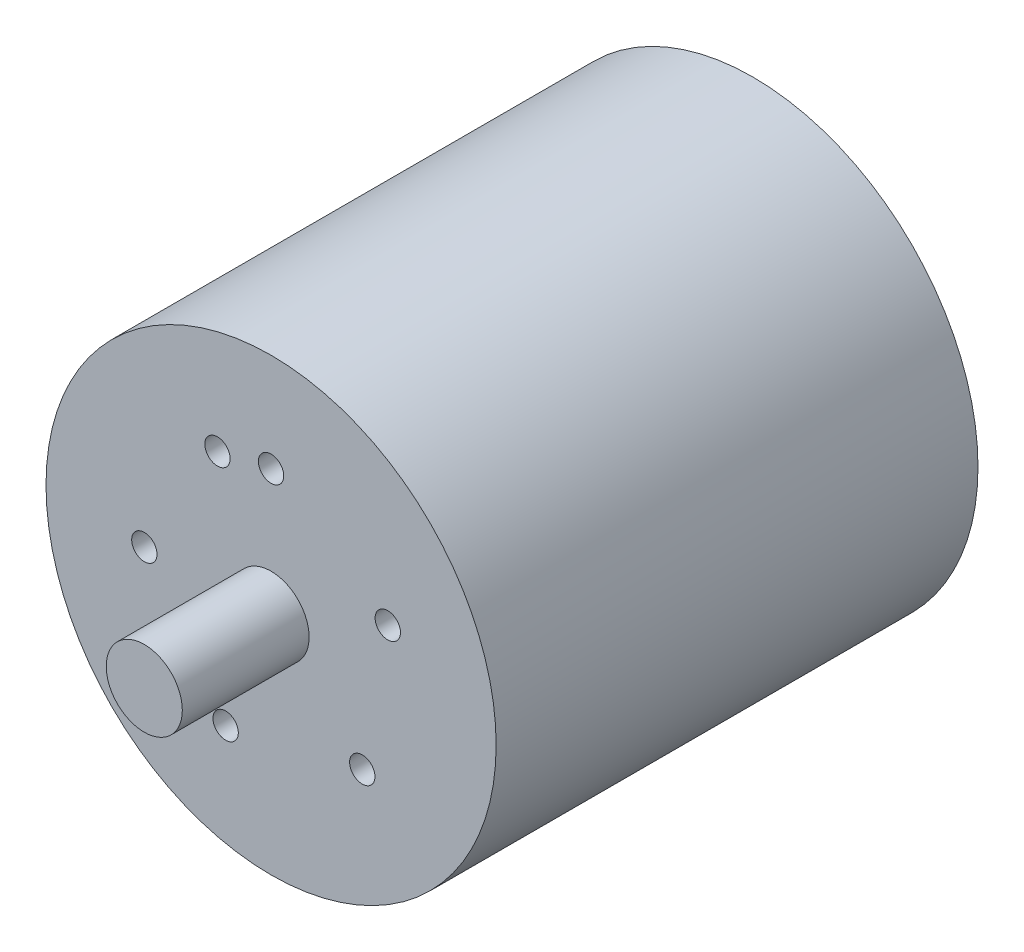
ISO-10303-21;
HEADER;
FILE_DESCRIPTION(('STEP AP214'),'2;1');
FILE_NAME('part.step','',(''),(''),'','','');
FILE_SCHEMA(('AUTOMOTIVE_DESIGN { 1 0 10303 214 1 1 1 1 }'));
ENDSEC;
DATA;
#1=APPLICATION_CONTEXT('core data for automotive mechanical design processes');
#2=APPLICATION_PROTOCOL_DEFINITION('international standard','automotive_design',2000,#1);
#3=PRODUCT_CONTEXT('',#1,'mechanical');
#4=PRODUCT('Part','Part','',(#3));
#5=PRODUCT_RELATED_PRODUCT_CATEGORY('part','',(#4));
#6=PRODUCT_DEFINITION_FORMATION('','',#4);
#7=PRODUCT_DEFINITION_CONTEXT('part definition',#1,'design');
#8=PRODUCT_DEFINITION('design','',#6,#7);
#9=PRODUCT_DEFINITION_SHAPE('','',#8);
#10=(LENGTH_UNIT() NAMED_UNIT(*) SI_UNIT(.MILLI.,.METRE.));
#11=(NAMED_UNIT(*) PLANE_ANGLE_UNIT() SI_UNIT($,.RADIAN.));
#12=(NAMED_UNIT(*) SI_UNIT($,.STERADIAN.) SOLID_ANGLE_UNIT());
#13=UNCERTAINTY_MEASURE_WITH_UNIT(LENGTH_MEASURE(1.E-05),#10,'distance_accuracy_value','');
#14=(GEOMETRIC_REPRESENTATION_CONTEXT(3) GLOBAL_UNCERTAINTY_ASSIGNED_CONTEXT((#13)) GLOBAL_UNIT_ASSIGNED_CONTEXT((#10,
#11,#12)) REPRESENTATION_CONTEXT('',''));
#15=CARTESIAN_POINT('',(0.,0.,0.));
#16=DIRECTION('',(0.,0.,1.));
#17=DIRECTION('',(1.,0.,0.));
#18=AXIS2_PLACEMENT_3D('',#15,#16,#17);
#19=CARTESIAN_POINT('',(0.,0.,19.));
#20=DIRECTION('',(0.,0.,-1.));
#21=DIRECTION('',(-1.,0.,0.));
#22=AXIS2_PLACEMENT_3D('',#19,#20,#21);
#23=CYLINDRICAL_SURFACE('',#22,17.75);
#24=CARTESIAN_POINT('',(0.,0.,19.));
#25=DIRECTION('',(0.,0.,1.));
#26=DIRECTION('',(1.,0.,0.));
#27=AXIS2_PLACEMENT_3D('',#24,#25,#26);
#28=CIRCLE('',#27,17.75);
#29=CARTESIAN_POINT('',(17.75,0.,19.));
#30=VERTEX_POINT('',#29);
#31=EDGE_CURVE('E10',#30,#30,#28,.T.);
#32=ORIENTED_EDGE('',*,*,#31,.F.);
#33=EDGE_LOOP('',(#32));
#34=FACE_BOUND('',#33,.T.);
#35=CARTESIAN_POINT('',(0.,0.,-19.));
#36=DIRECTION('',(0.,0.,1.));
#37=DIRECTION('',(1.,0.,0.));
#38=AXIS2_PLACEMENT_3D('',#35,#36,#37);
#39=CIRCLE('',#38,17.75);
#40=CARTESIAN_POINT('',(17.75,0.,-19.));
#41=VERTEX_POINT('',#40);
#42=EDGE_CURVE('E38',#41,#41,#39,.T.);
#43=ORIENTED_EDGE('',*,*,#42,.T.);
#44=EDGE_LOOP('',(#43));
#45=FACE_BOUND('',#44,.T.);
#46=ADVANCED_FACE('F35',(#34,#45),#23,.T.);
#47=CARTESIAN_POINT('',(0.,0.,19.));
#48=DIRECTION('',(0.,0.,1.));
#49=DIRECTION('',(1.,0.,0.));
#50=AXIS2_PLACEMENT_3D('',#47,#48,#49);
#51=PLANE('',#50);
#52=CARTESIAN_POINT('',(-4.22618261740691,9.06307787036654,19.));
#53=DIRECTION('',(0.,0.,1.));
#54=DIRECTION('',(0.906307787036654,0.422618261740691,0.));
#55=AXIS2_PLACEMENT_3D('',#52,#53,#54);
#56=CIRCLE('',#55,1.);
#57=CARTESIAN_POINT('',(-3.31987483037026,9.48569613210723,19.));
#58=VERTEX_POINT('',#57);
#59=EDGE_CURVE('E83',#58,#58,#56,.T.);
#60=ORIENTED_EDGE('',*,*,#59,.F.);
#61=EDGE_LOOP('',(#60));
#62=FACE_BOUND('',#61,.T.);
#63=CARTESIAN_POINT('',(-9.99390827019096,-0.348994967024937,19.));
#64=DIRECTION('',(0.,0.,1.));
#65=DIRECTION('',(-0.0348994967024937,0.999390827019096,0.));
#66=AXIS2_PLACEMENT_3D('',#63,#64,#65);
#67=CIRCLE('',#66,1.);
#68=CARTESIAN_POINT('',(-10.0288077668935,0.65039585999416,19.));
#69=VERTEX_POINT('',#68);
#70=EDGE_CURVE('E77',#69,#69,#67,.T.);
#71=ORIENTED_EDGE('',*,*,#70,.F.);
#72=EDGE_LOOP('',(#71));
#73=FACE_BOUND('',#72,.T.);
#74=CARTESIAN_POINT('',(-3.58367949545305,-9.335804264972,19.));
#75=DIRECTION('',(0.,0.,1.));
#76=DIRECTION('',(-0.9335804264972,0.358367949545305,0.));
#77=AXIS2_PLACEMENT_3D('',#74,#75,#76);
#78=CIRCLE('',#77,1.);
#79=CARTESIAN_POINT('',(-4.51725992195025,-8.9774363154267,19.));
#80=VERTEX_POINT('',#79);
#81=EDGE_CURVE('E71',#80,#80,#78,.T.);
#82=ORIENTED_EDGE('',*,*,#81,.F.);
#83=EDGE_LOOP('',(#82));
#84=FACE_BOUND('',#83,.T.);
#85=CARTESIAN_POINT('',(7.19339800338649,-6.94658370459,19.));
#86=DIRECTION('',(0.,0.,1.));
#87=DIRECTION('',(-0.694658370459,-0.719339800338649,0.));
#88=AXIS2_PLACEMENT_3D('',#85,#86,#87);
#89=CIRCLE('',#88,1.);
#90=CARTESIAN_POINT('',(6.49873963292749,-7.66592350492865,19.));
#91=VERTEX_POINT('',#90);
#92=EDGE_CURVE('E65',#91,#91,#89,.T.);
#93=ORIENTED_EDGE('',*,*,#92,.F.);
#94=EDGE_LOOP('',(#93));
#95=FACE_BOUND('',#94,.T.);
#96=CARTESIAN_POINT('',(9.20504853452441,3.90731128489272,19.));
#97=DIRECTION('',(0.,0.,1.));
#98=DIRECTION('',(0.390731128489272,-0.920504853452441,0.));
#99=AXIS2_PLACEMENT_3D('',#96,#97,#98);
#100=CIRCLE('',#99,1.);
#101=CARTESIAN_POINT('',(9.59577966301369,2.98680643144028,19.));
#102=VERTEX_POINT('',#101);
#103=EDGE_CURVE('E59',#102,#102,#100,.T.);
#104=ORIENTED_EDGE('',*,*,#103,.F.);
#105=EDGE_LOOP('',(#104));
#106=FACE_BOUND('',#105,.T.);
#107=CARTESIAN_POINT('',(0.,10.,19.));
#108=DIRECTION('',(0.,0.,1.));
#109=DIRECTION('',(1.,0.,0.));
#110=AXIS2_PLACEMENT_3D('',#107,#108,#109);
#111=CIRCLE('',#110,1.);
#112=CARTESIAN_POINT('',(1.,10.,19.));
#113=VERTEX_POINT('',#112);
#114=EDGE_CURVE('E53',#113,#113,#111,.T.);
#115=ORIENTED_EDGE('',*,*,#114,.F.);
#116=EDGE_LOOP('',(#115));
#117=FACE_BOUND('',#116,.T.);
#118=CARTESIAN_POINT('',(0.,0.,19.));
#119=DIRECTION('',(0.,0.,1.));
#120=DIRECTION('',(1.,0.,0.));
#121=AXIS2_PLACEMENT_3D('',#118,#119,#120);
#122=CIRCLE('',#121,3.);
#123=CARTESIAN_POINT('',(3.,0.,19.));
#124=VERTEX_POINT('',#123);
#125=EDGE_CURVE('E47',#124,#124,#122,.T.);
#126=ORIENTED_EDGE('',*,*,#125,.F.);
#127=EDGE_LOOP('',(#126));
#128=FACE_BOUND('',#127,.T.);
#129=ORIENTED_EDGE('',*,*,#31,.T.);
#130=EDGE_LOOP('',(#129));
#131=FACE_BOUND('',#130,.T.);
#132=ADVANCED_FACE('F98',(#62,#73,#84,#95,#106,#117,#128,#131),#51,.T.);
#133=CARTESIAN_POINT('',(0.,0.,-19.));
#134=DIRECTION('',(0.,0.,1.));
#135=DIRECTION('',(1.,0.,0.));
#136=AXIS2_PLACEMENT_3D('',#133,#134,#135);
#137=PLANE('',#136);
#138=ORIENTED_EDGE('',*,*,#42,.F.);
#139=EDGE_LOOP('',(#138));
#140=FACE_BOUND('',#139,.T.);
#141=ADVANCED_FACE('F101',(#140),#137,.F.);
#142=CARTESIAN_POINT('',(0.,0.,29.));
#143=DIRECTION('',(0.,0.,-1.));
#144=DIRECTION('',(-1.,0.,0.));
#145=AXIS2_PLACEMENT_3D('',#142,#143,#144);
#146=CYLINDRICAL_SURFACE('',#145,3.);
#147=CARTESIAN_POINT('',(0.,0.,29.));
#148=DIRECTION('',(0.,0.,1.));
#149=DIRECTION('',(1.,0.,0.));
#150=AXIS2_PLACEMENT_3D('',#147,#148,#149);
#151=CIRCLE('',#150,3.);
#152=CARTESIAN_POINT('',(3.,0.,29.));
#153=VERTEX_POINT('',#152);
#154=EDGE_CURVE('E45',#153,#153,#151,.T.);
#155=ORIENTED_EDGE('',*,*,#154,.F.);
#156=EDGE_LOOP('',(#155));
#157=FACE_BOUND('',#156,.T.);
#158=ORIENTED_EDGE('',*,*,#125,.T.);
#159=EDGE_LOOP('',(#158));
#160=FACE_BOUND('',#159,.T.);
#161=ADVANCED_FACE('F115',(#157,#160),#146,.T.);
#162=CARTESIAN_POINT('',(0.,0.,29.));
#163=DIRECTION('',(0.,0.,1.));
#164=DIRECTION('',(1.,0.,0.));
#165=AXIS2_PLACEMENT_3D('',#162,#163,#164);
#166=PLANE('',#165);
#167=ORIENTED_EDGE('',*,*,#154,.T.);
#168=EDGE_LOOP('',(#167));
#169=FACE_BOUND('',#168,.T.);
#170=ADVANCED_FACE('F117',(#169),#166,.T.);
#171=CARTESIAN_POINT('',(0.,10.,17.));
#172=DIRECTION('',(0.,0.,1.));
#173=DIRECTION('',(1.,0.,0.));
#174=AXIS2_PLACEMENT_3D('',#171,#172,#173);
#175=CYLINDRICAL_SURFACE('',#174,1.);
#176=CARTESIAN_POINT('',(0.,10.,17.));
#177=DIRECTION('',(0.,0.,1.));
#178=DIRECTION('',(1.,0.,0.));
#179=AXIS2_PLACEMENT_3D('',#176,#177,#178);
#180=CIRCLE('',#179,1.);
#181=CARTESIAN_POINT('',(1.,10.,17.));
#182=VERTEX_POINT('',#181);
#183=EDGE_CURVE('E50',#182,#182,#180,.T.);
#184=ORIENTED_EDGE('',*,*,#183,.F.);
#185=EDGE_LOOP('',(#184));
#186=FACE_BOUND('',#185,.T.);
#187=ORIENTED_EDGE('',*,*,#114,.T.);
#188=EDGE_LOOP('',(#187));
#189=FACE_BOUND('',#188,.T.);
#190=ADVANCED_FACE('F124',(#186,#189),#175,.F.);
#191=CARTESIAN_POINT('',(0.,10.,17.));
#192=DIRECTION('',(0.,0.,1.));
#193=DIRECTION('',(1.,0.,0.));
#194=AXIS2_PLACEMENT_3D('',#191,#192,#193);
#195=PLANE('',#194);
#196=ORIENTED_EDGE('',*,*,#183,.T.);
#197=EDGE_LOOP('',(#196));
#198=FACE_BOUND('',#197,.T.);
#199=ADVANCED_FACE('F165',(#198),#195,.T.);
#200=CARTESIAN_POINT('',(9.20504853452441,3.90731128489272,17.));
#201=DIRECTION('',(0.,0.,1.));
#202=DIRECTION('',(1.,0.,0.));
#203=AXIS2_PLACEMENT_3D('',#200,#201,#202);
#204=CYLINDRICAL_SURFACE('',#203,1.);
#205=CARTESIAN_POINT('',(9.20504853452441,3.90731128489272,17.));
#206=DIRECTION('',(0.,0.,1.));
#207=DIRECTION('',(0.390731128489272,-0.920504853452441,0.));
#208=AXIS2_PLACEMENT_3D('',#205,#206,#207);
#209=CIRCLE('',#208,1.);
#210=CARTESIAN_POINT('',(9.59577966301369,2.98680643144028,17.));
#211=VERTEX_POINT('',#210);
#212=EDGE_CURVE('E56',#211,#211,#209,.T.);
#213=ORIENTED_EDGE('',*,*,#212,.F.);
#214=EDGE_LOOP('',(#213));
#215=FACE_BOUND('',#214,.T.);
#216=ORIENTED_EDGE('',*,*,#103,.T.);
#217=EDGE_LOOP('',(#216));
#218=FACE_BOUND('',#217,.T.);
#219=ADVANCED_FACE('F174',(#215,#218),#204,.F.);
#220=CARTESIAN_POINT('',(9.20504853452441,3.90731128489272,17.));
#221=DIRECTION('',(0.,0.,1.));
#222=DIRECTION('',(0.390731128489272,-0.920504853452441,0.));
#223=AXIS2_PLACEMENT_3D('',#220,#221,#222);
#224=PLANE('',#223);
#225=ORIENTED_EDGE('',*,*,#212,.T.);
#226=EDGE_LOOP('',(#225));
#227=FACE_BOUND('',#226,.T.);
#228=ADVANCED_FACE('F188',(#227),#224,.T.);
#229=CARTESIAN_POINT('',(7.19339800338649,-6.94658370459,17.));
#230=DIRECTION('',(0.,0.,1.));
#231=DIRECTION('',(1.,0.,0.));
#232=AXIS2_PLACEMENT_3D('',#229,#230,#231);
#233=CYLINDRICAL_SURFACE('',#232,1.);
#234=CARTESIAN_POINT('',(7.19339800338649,-6.94658370459,17.));
#235=DIRECTION('',(0.,0.,1.));
#236=DIRECTION('',(-0.694658370459,-0.719339800338649,0.));
#237=AXIS2_PLACEMENT_3D('',#234,#235,#236);
#238=CIRCLE('',#237,1.);
#239=CARTESIAN_POINT('',(6.49873963292749,-7.66592350492865,17.));
#240=VERTEX_POINT('',#239);
#241=EDGE_CURVE('E62',#240,#240,#238,.T.);
#242=ORIENTED_EDGE('',*,*,#241,.F.);
#243=EDGE_LOOP('',(#242));
#244=FACE_BOUND('',#243,.T.);
#245=ORIENTED_EDGE('',*,*,#92,.T.);
#246=EDGE_LOOP('',(#245));
#247=FACE_BOUND('',#246,.T.);
#248=ADVANCED_FACE('F198',(#244,#247),#233,.F.);
#249=CARTESIAN_POINT('',(7.19339800338649,-6.94658370459,17.));
#250=DIRECTION('',(0.,0.,1.));
#251=DIRECTION('',(-0.694658370459,-0.719339800338649,0.));
#252=AXIS2_PLACEMENT_3D('',#249,#250,#251);
#253=PLANE('',#252);
#254=ORIENTED_EDGE('',*,*,#241,.T.);
#255=EDGE_LOOP('',(#254));
#256=FACE_BOUND('',#255,.T.);
#257=ADVANCED_FACE('F208',(#256),#253,.T.);
#258=CARTESIAN_POINT('',(-3.58367949545305,-9.335804264972,17.));
#259=DIRECTION('',(0.,0.,1.));
#260=DIRECTION('',(1.,0.,0.));
#261=AXIS2_PLACEMENT_3D('',#258,#259,#260);
#262=CYLINDRICAL_SURFACE('',#261,1.);
#263=CARTESIAN_POINT('',(-3.58367949545305,-9.335804264972,17.));
#264=DIRECTION('',(0.,0.,1.));
#265=DIRECTION('',(-0.9335804264972,0.358367949545305,0.));
#266=AXIS2_PLACEMENT_3D('',#263,#264,#265);
#267=CIRCLE('',#266,1.);
#268=CARTESIAN_POINT('',(-4.51725992195025,-8.9774363154267,17.));
#269=VERTEX_POINT('',#268);
#270=EDGE_CURVE('E68',#269,#269,#267,.T.);
#271=ORIENTED_EDGE('',*,*,#270,.F.);
#272=EDGE_LOOP('',(#271));
#273=FACE_BOUND('',#272,.T.);
#274=ORIENTED_EDGE('',*,*,#81,.T.);
#275=EDGE_LOOP('',(#274));
#276=FACE_BOUND('',#275,.T.);
#277=ADVANCED_FACE('F218',(#273,#276),#262,.F.);
#278=CARTESIAN_POINT('',(-3.58367949545305,-9.335804264972,17.));
#279=DIRECTION('',(0.,0.,1.));
#280=DIRECTION('',(-0.9335804264972,0.358367949545305,0.));
#281=AXIS2_PLACEMENT_3D('',#278,#279,#280);
#282=PLANE('',#281);
#283=ORIENTED_EDGE('',*,*,#270,.T.);
#284=EDGE_LOOP('',(#283));
#285=FACE_BOUND('',#284,.T.);
#286=ADVANCED_FACE('F228',(#285),#282,.T.);
#287=CARTESIAN_POINT('',(-9.99390827019096,-0.348994967024937,17.));
#288=DIRECTION('',(0.,0.,1.));
#289=DIRECTION('',(1.,0.,0.));
#290=AXIS2_PLACEMENT_3D('',#287,#288,#289);
#291=CYLINDRICAL_SURFACE('',#290,1.);
#292=CARTESIAN_POINT('',(-9.99390827019096,-0.348994967024937,17.));
#293=DIRECTION('',(0.,0.,1.));
#294=DIRECTION('',(-0.0348994967024937,0.999390827019096,0.));
#295=AXIS2_PLACEMENT_3D('',#292,#293,#294);
#296=CIRCLE('',#295,1.);
#297=CARTESIAN_POINT('',(-10.0288077668935,0.65039585999416,17.));
#298=VERTEX_POINT('',#297);
#299=EDGE_CURVE('E74',#298,#298,#296,.T.);
#300=ORIENTED_EDGE('',*,*,#299,.F.);
#301=EDGE_LOOP('',(#300));
#302=FACE_BOUND('',#301,.T.);
#303=ORIENTED_EDGE('',*,*,#70,.T.);
#304=EDGE_LOOP('',(#303));
#305=FACE_BOUND('',#304,.T.);
#306=ADVANCED_FACE('F238',(#302,#305),#291,.F.);
#307=CARTESIAN_POINT('',(-9.99390827019096,-0.348994967024937,17.));
#308=DIRECTION('',(0.,0.,1.));
#309=DIRECTION('',(-0.0348994967024937,0.999390827019096,0.));
#310=AXIS2_PLACEMENT_3D('',#307,#308,#309);
#311=PLANE('',#310);
#312=ORIENTED_EDGE('',*,*,#299,.T.);
#313=EDGE_LOOP('',(#312));
#314=FACE_BOUND('',#313,.T.);
#315=ADVANCED_FACE('F94',(#314),#311,.T.);
#316=CARTESIAN_POINT('',(-4.22618261740691,9.06307787036654,17.));
#317=DIRECTION('',(0.,0.,1.));
#318=DIRECTION('',(1.,0.,0.));
#319=AXIS2_PLACEMENT_3D('',#316,#317,#318);
#320=CYLINDRICAL_SURFACE('',#319,1.);
#321=CARTESIAN_POINT('',(-4.22618261740691,9.06307787036654,17.));
#322=DIRECTION('',(0.,0.,1.));
#323=DIRECTION('',(0.906307787036654,0.422618261740691,0.));
#324=AXIS2_PLACEMENT_3D('',#321,#322,#323);
#325=CIRCLE('',#324,1.);
#326=CARTESIAN_POINT('',(-3.31987483037026,9.48569613210723,17.));
#327=VERTEX_POINT('',#326);
#328=EDGE_CURVE('E80',#327,#327,#325,.T.);
#329=ORIENTED_EDGE('',*,*,#328,.F.);
#330=EDGE_LOOP('',(#329));
#331=FACE_BOUND('',#330,.T.);
#332=ORIENTED_EDGE('',*,*,#59,.T.);
#333=EDGE_LOOP('',(#332));
#334=FACE_BOUND('',#333,.T.);
#335=ADVANCED_FACE('F91',(#331,#334),#320,.F.);
#336=CARTESIAN_POINT('',(-4.22618261740691,9.06307787036654,17.));
#337=DIRECTION('',(0.,0.,1.));
#338=DIRECTION('',(0.906307787036654,0.422618261740691,0.));
#339=AXIS2_PLACEMENT_3D('',#336,#337,#338);
#340=PLANE('',#339);
#341=ORIENTED_EDGE('',*,*,#328,.T.);
#342=EDGE_LOOP('',(#341));
#343=FACE_BOUND('',#342,.T.);
#344=ADVANCED_FACE('F89',(#343),#340,.T.);
#345=CLOSED_SHELL('',(#46,#132,#141,#161,#170,#190,#199,#219,#228,#248,#257,#277,#286,#306,#315,
#335,#344));
#346=MANIFOLD_SOLID_BREP('B2',#345);
#347=ADVANCED_BREP_SHAPE_REPRESENTATION('',(#18,#346),#14);
#348=SHAPE_DEFINITION_REPRESENTATION(#9,#347);
ENDSEC;
END-ISO-10303-21;
